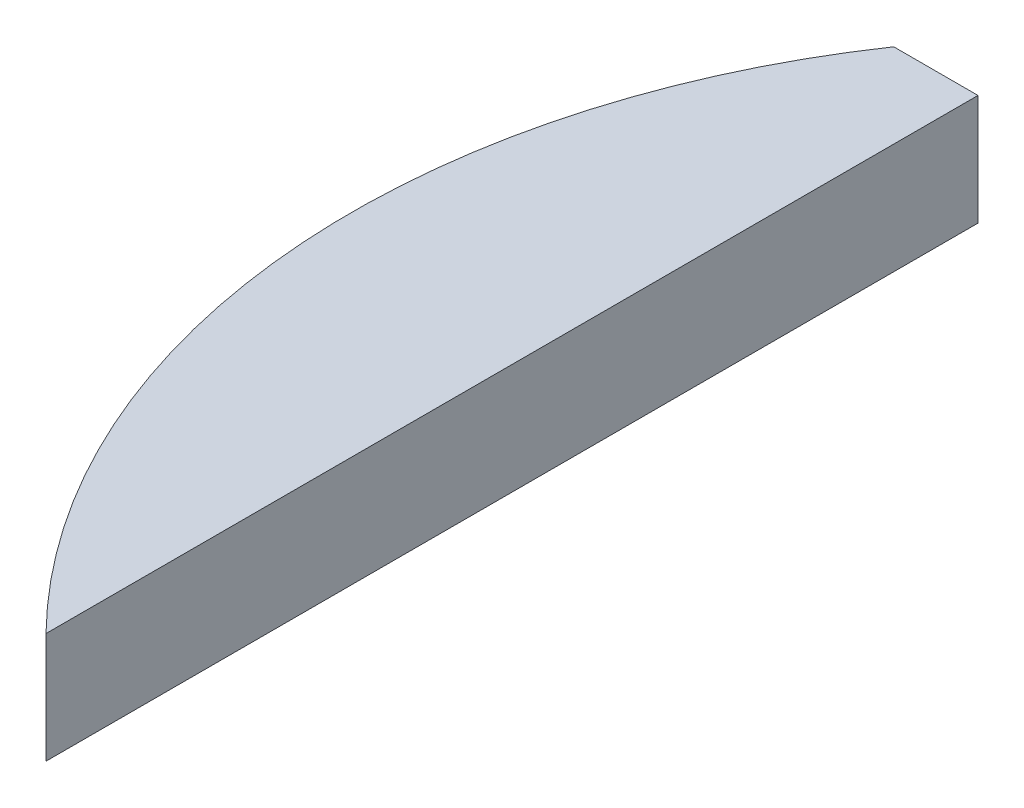
ISO-10303-21;
HEADER;
FILE_DESCRIPTION(('STEP AP214'),'2;1');
FILE_NAME('part.step','',(''),(''),'','','');
FILE_SCHEMA(('AUTOMOTIVE_DESIGN { 1 0 10303 214 1 1 1 1 }'));
ENDSEC;
DATA;
#1=APPLICATION_CONTEXT('core data for automotive mechanical design processes');
#2=APPLICATION_PROTOCOL_DEFINITION('international standard','automotive_design',2000,#1);
#3=PRODUCT_CONTEXT('',#1,'mechanical');
#4=PRODUCT('Part','Part','',(#3));
#5=PRODUCT_RELATED_PRODUCT_CATEGORY('part','',(#4));
#6=PRODUCT_DEFINITION_FORMATION('','',#4);
#7=PRODUCT_DEFINITION_CONTEXT('part definition',#1,'design');
#8=PRODUCT_DEFINITION('design','',#6,#7);
#9=PRODUCT_DEFINITION_SHAPE('','',#8);
#10=(LENGTH_UNIT() NAMED_UNIT(*) SI_UNIT(.MILLI.,.METRE.));
#11=(NAMED_UNIT(*) PLANE_ANGLE_UNIT() SI_UNIT($,.RADIAN.));
#12=(NAMED_UNIT(*) SI_UNIT($,.STERADIAN.) SOLID_ANGLE_UNIT());
#13=UNCERTAINTY_MEASURE_WITH_UNIT(LENGTH_MEASURE(1.E-05),#10,'distance_accuracy_value','');
#14=(GEOMETRIC_REPRESENTATION_CONTEXT(3) GLOBAL_UNCERTAINTY_ASSIGNED_CONTEXT((#13)) GLOBAL_UNIT_ASSIGNED_CONTEXT((#10,
#11,#12)) REPRESENTATION_CONTEXT('',''));
#15=CARTESIAN_POINT('',(0.,0.,0.));
#16=DIRECTION('',(0.,0.,1.));
#17=DIRECTION('',(1.,0.,0.));
#18=AXIS2_PLACEMENT_3D('',#15,#16,#17);
#19=CARTESIAN_POINT('',(0.,-23.,7.62499996274701));
#20=DIRECTION('',(0.,1.,0.));
#21=DIRECTION('',(0.,0.,1.));
#22=AXIS2_PLACEMENT_3D('',#19,#20,#21);
#23=PLANE('',#22);
#24=DIRECTION('',(0.,0.,1.));
#25=VECTOR('',#24,1.);
#26=CARTESIAN_POINT('',(-14.2499999999995,-23.,11.9999999999998));
#27=LINE('',#26,#25);
#28=CARTESIAN_POINT('',(-14.2499999999989,-23.,-11.2500000000054));
#29=VERTEX_POINT('',#28);
#30=CARTESIAN_POINT('',(-14.2500000000019,-22.9999998809536,14.0334423068649));
#31=VERTEX_POINT('',#30);
#32=EDGE_CURVE('E52',#29,#31,#27,.T.);
#33=ORIENTED_EDGE('',*,*,#32,.T.);
#34=CARTESIAN_POINT('',(1.16573417585641E-13,-22.9999997619072,0.));
#35=DIRECTION('',(0.,-1.,0.));
#36=DIRECTION('',(0.,0.,-1.));
#37=AXIS2_PLACEMENT_3D('',#34,#35,#36);
#38=CIRCLE('',#37,20.0000000745058);
#39=CARTESIAN_POINT('',(-16.5359457842672,-22.9999998809536,-11.2500000000002));
#40=VERTEX_POINT('',#39);
#41=EDGE_CURVE('E20',#40,#31,#38,.F.);
#42=ORIENTED_EDGE('',*,*,#41,.F.);
#43=DIRECTION('',(-1.,0.,0.));
#44=VECTOR('',#43,1.);
#45=CARTESIAN_POINT('',(-12.2499999999998,-23.,-11.2500000000002));
#46=LINE('',#45,#44);
#47=EDGE_CURVE('E46',#29,#40,#46,.T.);
#48=ORIENTED_EDGE('',*,*,#47,.F.);
#49=EDGE_LOOP('',(#33,#42,#48));
#50=FACE_BOUND('',#49,.T.);
#51=ADVANCED_FACE('F17',(#50),#23,.F.);
#52=CARTESIAN_POINT('',(-14.2499999999995,-33.4535583778433,11.9999999999998));
#53=DIRECTION('',(-1.,0.,0.));
#54=DIRECTION('',(0.,0.,1.));
#55=AXIS2_PLACEMENT_3D('',#52,#53,#54);
#56=PLANE('',#55);
#57=DIRECTION('',(0.,0.,1.));
#58=VECTOR('',#57,1.);
#59=CARTESIAN_POINT('',(-14.2499999999995,-20.,7.62499996274701));
#60=LINE('',#59,#58);
#61=CARTESIAN_POINT('',(-14.2500000000042,-20.,14.0334423068649));
#62=VERTEX_POINT('',#61);
#63=CARTESIAN_POINT('',(-14.2499999999993,-20.,-11.2500000000106));
#64=VERTEX_POINT('',#63);
#65=EDGE_CURVE('E74',#62,#64,#60,.F.);
#66=ORIENTED_EDGE('',*,*,#65,.F.);
#67=DIRECTION('',(0.,-1.,0.));
#68=VECTOR('',#67,1.);
#69=CARTESIAN_POINT('',(-14.2500000000089,-20.,14.0334423068602));
#70=LINE('',#69,#68);
#71=EDGE_CURVE('E56',#31,#62,#70,.F.);
#72=ORIENTED_EDGE('',*,*,#71,.F.);
#73=ORIENTED_EDGE('',*,*,#32,.F.);
#74=DIRECTION('',(0.,1.,0.));
#75=VECTOR('',#74,1.);
#76=CARTESIAN_POINT('',(-14.2499999999989,-23.,-11.2500000000002));
#77=LINE('',#76,#75);
#78=EDGE_CURVE('E54',#64,#29,#77,.F.);
#79=ORIENTED_EDGE('',*,*,#78,.F.);
#80=EDGE_LOOP('',(#66,#72,#73,#79));
#81=FACE_BOUND('',#80,.T.);
#82=ADVANCED_FACE('F53',(#81),#56,.F.);
#83=CARTESIAN_POINT('',(-12.2499999999998,-23.,-11.2500000000002));
#84=DIRECTION('',(0.,0.,-1.));
#85=DIRECTION('',(-1.,0.,0.));
#86=AXIS2_PLACEMENT_3D('',#83,#84,#85);
#87=PLANE('',#86);
#88=DIRECTION('',(0.,-1.,0.));
#89=VECTOR('',#88,1.);
#90=CARTESIAN_POINT('',(-16.5359457842672,-20.,-11.2500000000002));
#91=LINE('',#90,#89);
#92=CARTESIAN_POINT('',(-16.5359457842619,-20.,-11.250000000008));
#93=VERTEX_POINT('',#92);
#94=EDGE_CURVE('E34',#93,#40,#91,.T.);
#95=ORIENTED_EDGE('',*,*,#94,.F.);
#96=DIRECTION('',(1.,0.,0.));
#97=VECTOR('',#96,1.);
#98=CARTESIAN_POINT('',(0.,-20.,-11.2500000000158));
#99=LINE('',#98,#97);
#100=EDGE_CURVE('E26',#64,#93,#99,.F.);
#101=ORIENTED_EDGE('',*,*,#100,.F.);
#102=ORIENTED_EDGE('',*,*,#78,.T.);
#103=ORIENTED_EDGE('',*,*,#47,.T.);
#104=EDGE_LOOP('',(#95,#101,#102,#103));
#105=FACE_BOUND('',#104,.T.);
#106=ADVANCED_FACE('F61',(#105),#87,.T.);
#107=CARTESIAN_POINT('',(1.16573417585641E-13,-20.,0.));
#108=DIRECTION('',(0.,-1.,0.));
#109=DIRECTION('',(0.,0.,-1.));
#110=AXIS2_PLACEMENT_3D('',#107,#108,#109);
#111=CYLINDRICAL_SURFACE('',#110,20.0000000745058);
#112=ORIENTED_EDGE('',*,*,#41,.T.);
#113=ORIENTED_EDGE('',*,*,#71,.T.);
#114=CARTESIAN_POINT('',(1.16573417585641E-13,-20.,0.));
#115=DIRECTION('',(0.,-1.,0.));
#116=DIRECTION('',(0.,0.,-1.));
#117=AXIS2_PLACEMENT_3D('',#114,#115,#116);
#118=CIRCLE('',#117,20.0000000745058);
#119=EDGE_CURVE('E11',#93,#62,#118,.F.);
#120=ORIENTED_EDGE('',*,*,#119,.F.);
#121=ORIENTED_EDGE('',*,*,#94,.T.);
#122=EDGE_LOOP('',(#112,#113,#120,#121));
#123=FACE_BOUND('',#122,.T.);
#124=ADVANCED_FACE('F83',(#123),#111,.T.);
#125=CARTESIAN_POINT('',(0.,-20.,7.62499996274701));
#126=DIRECTION('',(0.,1.,0.));
#127=DIRECTION('',(0.,0.,1.));
#128=AXIS2_PLACEMENT_3D('',#125,#126,#127);
#129=PLANE('',#128);
#130=ORIENTED_EDGE('',*,*,#100,.T.);
#131=ORIENTED_EDGE('',*,*,#119,.T.);
#132=ORIENTED_EDGE('',*,*,#65,.T.);
#133=EDGE_LOOP('',(#130,#131,#132));
#134=FACE_BOUND('',#133,.T.);
#135=ADVANCED_FACE('F81',(#134),#129,.T.);
#136=CLOSED_SHELL('',(#51,#82,#106,#124,#135));
#137=MANIFOLD_SOLID_BREP('B1',#136);
#138=ADVANCED_BREP_SHAPE_REPRESENTATION('',(#18,#137),#14);
#139=SHAPE_DEFINITION_REPRESENTATION(#9,#138);
ENDSEC;
END-ISO-10303-21;
